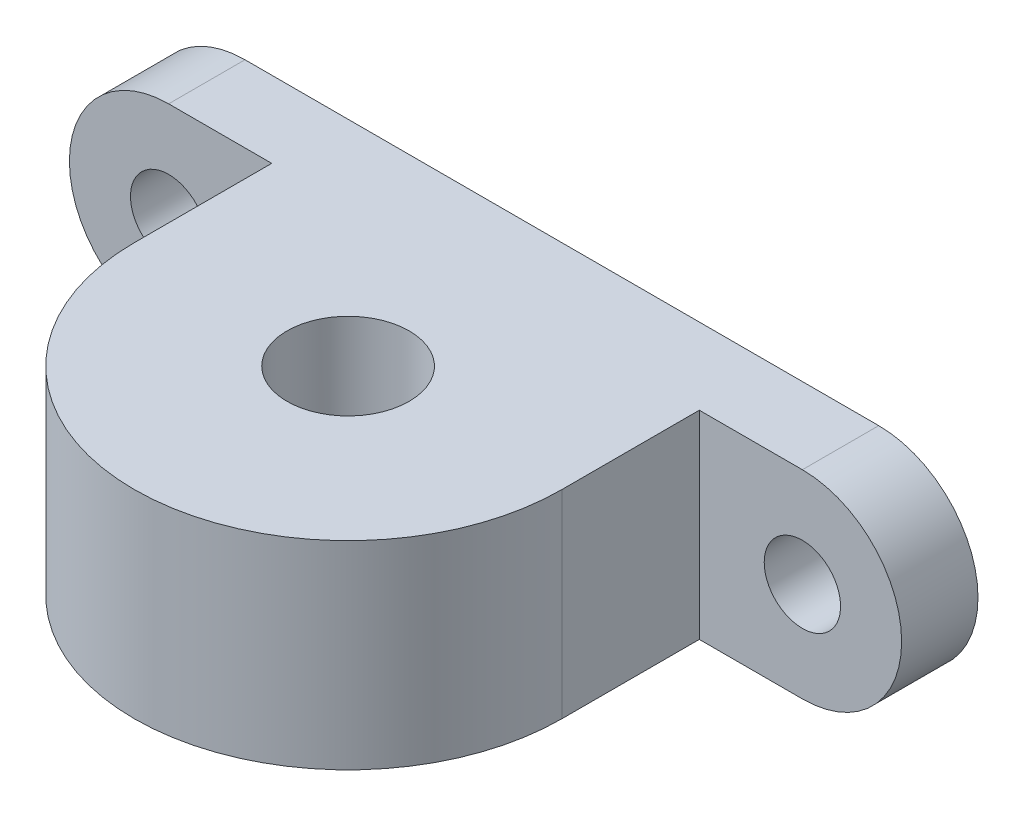
ISO-10303-21;
HEADER;
FILE_DESCRIPTION(('STEP AP214'),'2;1');
FILE_NAME('part.step','',(''),(''),'','','');
FILE_SCHEMA(('AUTOMOTIVE_DESIGN { 1 0 10303 214 1 1 1 1 }'));
ENDSEC;
DATA;
#1=APPLICATION_CONTEXT('core data for automotive mechanical design processes');
#2=APPLICATION_PROTOCOL_DEFINITION('international standard','automotive_design',2000,#1);
#3=PRODUCT_CONTEXT('',#1,'mechanical');
#4=PRODUCT('Part','Part','',(#3));
#5=PRODUCT_RELATED_PRODUCT_CATEGORY('part','',(#4));
#6=PRODUCT_DEFINITION_FORMATION('','',#4);
#7=PRODUCT_DEFINITION_CONTEXT('part definition',#1,'design');
#8=PRODUCT_DEFINITION('design','',#6,#7);
#9=PRODUCT_DEFINITION_SHAPE('','',#8);
#10=(LENGTH_UNIT() NAMED_UNIT(*) SI_UNIT(.MILLI.,.METRE.));
#11=(NAMED_UNIT(*) PLANE_ANGLE_UNIT() SI_UNIT($,.RADIAN.));
#12=(NAMED_UNIT(*) SI_UNIT($,.STERADIAN.) SOLID_ANGLE_UNIT());
#13=UNCERTAINTY_MEASURE_WITH_UNIT(LENGTH_MEASURE(1.E-05),#10,'distance_accuracy_value','');
#14=(GEOMETRIC_REPRESENTATION_CONTEXT(3) GLOBAL_UNCERTAINTY_ASSIGNED_CONTEXT((#13)) GLOBAL_UNIT_ASSIGNED_CONTEXT((#10,
#11,#12)) REPRESENTATION_CONTEXT('',''));
#15=CARTESIAN_POINT('',(0.,0.,0.));
#16=DIRECTION('',(0.,0.,1.));
#17=DIRECTION('',(1.,0.,0.));
#18=AXIS2_PLACEMENT_3D('',#15,#16,#17);
#19=CARTESIAN_POINT('',(-20.75,0.,5.));
#20=DIRECTION('',(0.,0.,1.));
#21=DIRECTION('',(1.,0.,0.));
#22=AXIS2_PLACEMENT_3D('',#19,#20,#21);
#23=PLANE('',#22);
#24=CARTESIAN_POINT('',(20.75,0.,5.));
#25=DIRECTION('',(0.,0.,1.));
#26=DIRECTION('',(-1.,0.,0.));
#27=AXIS2_PLACEMENT_3D('',#24,#25,#26);
#28=CIRCLE('',#27,2.5);
#29=CARTESIAN_POINT('',(18.25,0.,5.));
#30=VERTEX_POINT('',#29);
#31=EDGE_CURVE('E143',#30,#30,#28,.T.);
#32=ORIENTED_EDGE('',*,*,#31,.F.);
#33=EDGE_LOOP('',(#32));
#34=FACE_BOUND('',#33,.T.);
#35=DIRECTION('',(-1.,0.,0.));
#36=VECTOR('',#35,1.);
#37=CARTESIAN_POINT('',(-20.75,6.5,5.));
#38=LINE('',#37,#36);
#39=CARTESIAN_POINT('',(20.75,6.5,5.));
#40=VERTEX_POINT('',#39);
#41=CARTESIAN_POINT('',(14.,6.5,5.));
#42=VERTEX_POINT('',#41);
#43=EDGE_CURVE('E59',#40,#42,#38,.T.);
#44=ORIENTED_EDGE('',*,*,#43,.T.);
#45=DIRECTION('',(0.,-1.,0.));
#46=VECTOR('',#45,1.);
#47=CARTESIAN_POINT('',(14.,42.7353418639869,5.));
#48=LINE('',#47,#46);
#49=CARTESIAN_POINT('',(14.,-6.49999999999999,5.));
#50=VERTEX_POINT('',#49);
#51=EDGE_CURVE('E112',#42,#50,#48,.T.);
#52=ORIENTED_EDGE('',*,*,#51,.T.);
#53=DIRECTION('',(1.,0.,0.));
#54=VECTOR('',#53,1.);
#55=CARTESIAN_POINT('',(-20.75,-6.5,5.));
#56=LINE('',#55,#54);
#57=CARTESIAN_POINT('',(20.75,-6.49999999999999,5.));
#58=VERTEX_POINT('',#57);
#59=EDGE_CURVE('E127',#50,#58,#56,.T.);
#60=ORIENTED_EDGE('',*,*,#59,.T.);
#61=CARTESIAN_POINT('',(20.75,0.,5.));
#62=DIRECTION('',(0.,0.,1.));
#63=DIRECTION('',(-1.,0.,0.));
#64=AXIS2_PLACEMENT_3D('',#61,#62,#63);
#65=CIRCLE('',#64,6.49999999999999);
#66=EDGE_CURVE('E161',#58,#40,#65,.T.);
#67=ORIENTED_EDGE('',*,*,#66,.T.);
#68=EDGE_LOOP('',(#44,#52,#60,#67));
#69=FACE_BOUND('',#68,.T.);
#70=ADVANCED_FACE('F36',(#34,#69),#23,.T.);
#71=DIRECTION('',(0.,-1.,0.));
#72=VECTOR('',#71,1.);
#73=CARTESIAN_POINT('',(-14.,42.7353418639869,5.));
#74=LINE('',#73,#72);
#75=CARTESIAN_POINT('',(-14.,6.5,5.));
#76=VERTEX_POINT('',#75);
#77=CARTESIAN_POINT('',(-14.,-6.5,5.));
#78=VERTEX_POINT('',#77);
#79=EDGE_CURVE('E51',#76,#78,#74,.T.);
#80=ORIENTED_EDGE('',*,*,#79,.F.);
#81=CARTESIAN_POINT('',(-20.75,6.5,5.));
#82=VERTEX_POINT('',#81);
#83=EDGE_CURVE('E163',#76,#82,#38,.T.);
#84=ORIENTED_EDGE('',*,*,#83,.T.);
#85=CARTESIAN_POINT('',(-20.75,0.,5.));
#86=DIRECTION('',(0.,0.,1.));
#87=DIRECTION('',(1.,0.,0.));
#88=AXIS2_PLACEMENT_3D('',#85,#86,#87);
#89=CIRCLE('',#88,6.5);
#90=CARTESIAN_POINT('',(-20.75,-6.5,5.));
#91=VERTEX_POINT('',#90);
#92=EDGE_CURVE('E155',#82,#91,#89,.T.);
#93=ORIENTED_EDGE('',*,*,#92,.T.);
#94=EDGE_CURVE('E159',#91,#78,#56,.T.);
#95=ORIENTED_EDGE('',*,*,#94,.T.);
#96=EDGE_LOOP('',(#80,#84,#93,#95));
#97=FACE_BOUND('',#96,.T.);
#98=CARTESIAN_POINT('',(-20.75,0.,5.));
#99=DIRECTION('',(0.,0.,1.));
#100=DIRECTION('',(1.,0.,0.));
#101=AXIS2_PLACEMENT_3D('',#98,#99,#100);
#102=CIRCLE('',#101,2.5);
#103=CARTESIAN_POINT('',(-18.25,0.,5.));
#104=VERTEX_POINT('',#103);
#105=EDGE_CURVE('E149',#104,#104,#102,.T.);
#106=ORIENTED_EDGE('',*,*,#105,.F.);
#107=EDGE_LOOP('',(#106));
#108=FACE_BOUND('',#107,.T.);
#109=ADVANCED_FACE('F195',(#97,#108),#23,.T.);
#110=CARTESIAN_POINT('',(-20.75,0.,0.));
#111=DIRECTION('',(0.,0.,1.));
#112=DIRECTION('',(1.,0.,0.));
#113=AXIS2_PLACEMENT_3D('',#110,#111,#112);
#114=PLANE('',#113);
#115=CARTESIAN_POINT('',(-20.75,0.,0.));
#116=DIRECTION('',(0.,0.,1.));
#117=DIRECTION('',(1.,0.,0.));
#118=AXIS2_PLACEMENT_3D('',#115,#116,#117);
#119=CIRCLE('',#118,6.5);
#120=CARTESIAN_POINT('',(-20.75,6.5,0.));
#121=VERTEX_POINT('',#120);
#122=CARTESIAN_POINT('',(-20.75,-6.5,0.));
#123=VERTEX_POINT('',#122);
#124=EDGE_CURVE('E152',#121,#123,#119,.T.);
#125=ORIENTED_EDGE('',*,*,#124,.F.);
#126=DIRECTION('',(-1.,0.,0.));
#127=VECTOR('',#126,1.);
#128=CARTESIAN_POINT('',(-20.75,6.5,0.));
#129=LINE('',#128,#127);
#130=CARTESIAN_POINT('',(20.75,6.5,0.));
#131=VERTEX_POINT('',#130);
#132=EDGE_CURVE('E158',#131,#121,#129,.T.);
#133=ORIENTED_EDGE('',*,*,#132,.F.);
#134=CARTESIAN_POINT('',(20.75,0.,0.));
#135=DIRECTION('',(0.,0.,1.));
#136=DIRECTION('',(-1.,0.,0.));
#137=AXIS2_PLACEMENT_3D('',#134,#135,#136);
#138=CIRCLE('',#137,6.49999999999999);
#139=CARTESIAN_POINT('',(20.75,-6.49999999999999,0.));
#140=VERTEX_POINT('',#139);
#141=EDGE_CURVE('E170',#140,#131,#138,.T.);
#142=ORIENTED_EDGE('',*,*,#141,.F.);
#143=DIRECTION('',(1.,0.,0.));
#144=VECTOR('',#143,1.);
#145=CARTESIAN_POINT('',(-20.75,-6.5,0.));
#146=LINE('',#145,#144);
#147=EDGE_CURVE('E168',#123,#140,#146,.T.);
#148=ORIENTED_EDGE('',*,*,#147,.F.);
#149=EDGE_LOOP('',(#125,#133,#142,#148));
#150=FACE_BOUND('',#149,.T.);
#151=CARTESIAN_POINT('',(-20.75,0.,0.));
#152=DIRECTION('',(0.,0.,1.));
#153=DIRECTION('',(1.,0.,0.));
#154=AXIS2_PLACEMENT_3D('',#151,#152,#153);
#155=CIRCLE('',#154,2.5);
#156=CARTESIAN_POINT('',(-18.25,0.,0.));
#157=VERTEX_POINT('',#156);
#158=EDGE_CURVE('E146',#157,#157,#155,.T.);
#159=ORIENTED_EDGE('',*,*,#158,.T.);
#160=EDGE_LOOP('',(#159));
#161=FACE_BOUND('',#160,.T.);
#162=CARTESIAN_POINT('',(20.75,0.,0.));
#163=DIRECTION('',(0.,0.,1.));
#164=DIRECTION('',(-1.,0.,0.));
#165=AXIS2_PLACEMENT_3D('',#162,#163,#164);
#166=CIRCLE('',#165,2.5);
#167=CARTESIAN_POINT('',(18.25,0.,0.));
#168=VERTEX_POINT('',#167);
#169=EDGE_CURVE('E142',#168,#168,#166,.T.);
#170=ORIENTED_EDGE('',*,*,#169,.T.);
#171=EDGE_LOOP('',(#170));
#172=FACE_BOUND('',#171,.T.);
#173=ADVANCED_FACE('F186',(#150,#161,#172),#114,.F.);
#174=CARTESIAN_POINT('',(-20.75,0.,5.));
#175=DIRECTION('',(0.,0.,-1.));
#176=DIRECTION('',(-1.,0.,0.));
#177=AXIS2_PLACEMENT_3D('',#174,#175,#176);
#178=CYLINDRICAL_SURFACE('',#177,6.5);
#179=ORIENTED_EDGE('',*,*,#124,.T.);
#180=DIRECTION('',(0.,0.,-1.));
#181=VECTOR('',#180,1.);
#182=CARTESIAN_POINT('',(-20.75,-6.5,5.));
#183=LINE('',#182,#181);
#184=EDGE_CURVE('E11',#91,#123,#183,.T.);
#185=ORIENTED_EDGE('',*,*,#184,.F.);
#186=ORIENTED_EDGE('',*,*,#92,.F.);
#187=DIRECTION('',(0.,0.,-1.));
#188=VECTOR('',#187,1.);
#189=CARTESIAN_POINT('',(-20.75,6.5,5.));
#190=LINE('',#189,#188);
#191=EDGE_CURVE('E165',#82,#121,#190,.T.);
#192=ORIENTED_EDGE('',*,*,#191,.T.);
#193=EDGE_LOOP('',(#179,#185,#186,#192));
#194=FACE_BOUND('',#193,.T.);
#195=ADVANCED_FACE('F38',(#194),#178,.T.);
#196=CARTESIAN_POINT('',(-20.75,-6.5,5.));
#197=DIRECTION('',(0.,1.,0.));
#198=DIRECTION('',(-1.,0.,0.));
#199=AXIS2_PLACEMENT_3D('',#196,#197,#198);
#200=PLANE('',#199);
#201=ORIENTED_EDGE('',*,*,#147,.T.);
#202=DIRECTION('',(0.,0.,-1.));
#203=VECTOR('',#202,1.);
#204=CARTESIAN_POINT('',(20.75,-6.49999999999999,5.));
#205=LINE('',#204,#203);
#206=EDGE_CURVE('E44',#58,#140,#205,.T.);
#207=ORIENTED_EDGE('',*,*,#206,.F.);
#208=ORIENTED_EDGE('',*,*,#59,.F.);
#209=DIRECTION('',(0.,0.,1.));
#210=VECTOR('',#209,1.);
#211=CARTESIAN_POINT('',(14.,-6.49999999999999,14.));
#212=LINE('',#211,#210);
#213=CARTESIAN_POINT('',(14.,-6.49999999999999,14.));
#214=VERTEX_POINT('',#213);
#215=EDGE_CURVE('E107',#50,#214,#212,.T.);
#216=ORIENTED_EDGE('',*,*,#215,.T.);
#217=CARTESIAN_POINT('',(0.,-6.49999999999999,14.));
#218=DIRECTION('',(0.,-1.,0.));
#219=DIRECTION('',(1.,0.,0.));
#220=AXIS2_PLACEMENT_3D('',#217,#218,#219);
#221=CIRCLE('',#220,14.);
#222=CARTESIAN_POINT('',(-14.,-6.5,14.));
#223=VERTEX_POINT('',#222);
#224=EDGE_CURVE('E115',#214,#223,#221,.T.);
#225=ORIENTED_EDGE('',*,*,#224,.T.);
#226=DIRECTION('',(0.,0.,-1.));
#227=VECTOR('',#226,1.);
#228=CARTESIAN_POINT('',(-14.,-6.5,14.));
#229=LINE('',#228,#227);
#230=EDGE_CURVE('E121',#223,#78,#229,.T.);
#231=ORIENTED_EDGE('',*,*,#230,.T.);
#232=ORIENTED_EDGE('',*,*,#94,.F.);
#233=ORIENTED_EDGE('',*,*,#184,.T.);
#234=EDGE_LOOP('',(#201,#207,#208,#216,#225,#231,#232,#233));
#235=FACE_BOUND('',#234,.T.);
#236=CARTESIAN_POINT('',(0.,-6.49999999999999,14.));
#237=DIRECTION('',(0.,-1.,0.));
#238=DIRECTION('',(1.,0.,0.));
#239=AXIS2_PLACEMENT_3D('',#236,#237,#238);
#240=CIRCLE('',#239,4.);
#241=CARTESIAN_POINT('',(4.,-6.49999999999999,14.));
#242=VERTEX_POINT('',#241);
#243=EDGE_CURVE('E128',#242,#242,#240,.T.);
#244=ORIENTED_EDGE('',*,*,#243,.F.);
#245=EDGE_LOOP('',(#244));
#246=FACE_BOUND('',#245,.T.);
#247=ADVANCED_FACE('F124',(#235,#246),#200,.F.);
#248=CARTESIAN_POINT('',(20.75,0.,5.));
#249=DIRECTION('',(0.,0.,-1.));
#250=DIRECTION('',(-1.,0.,0.));
#251=AXIS2_PLACEMENT_3D('',#248,#249,#250);
#252=CYLINDRICAL_SURFACE('',#251,6.49999999999999);
#253=ORIENTED_EDGE('',*,*,#141,.T.);
#254=DIRECTION('',(0.,0.,-1.));
#255=VECTOR('',#254,1.);
#256=CARTESIAN_POINT('',(20.75,6.5,5.));
#257=LINE('',#256,#255);
#258=EDGE_CURVE('E175',#40,#131,#257,.T.);
#259=ORIENTED_EDGE('',*,*,#258,.F.);
#260=ORIENTED_EDGE('',*,*,#66,.F.);
#261=ORIENTED_EDGE('',*,*,#206,.T.);
#262=EDGE_LOOP('',(#253,#259,#260,#261));
#263=FACE_BOUND('',#262,.T.);
#264=ADVANCED_FACE('F181',(#263),#252,.T.);
#265=CARTESIAN_POINT('',(-20.75,6.5,5.));
#266=DIRECTION('',(0.,-1.,0.));
#267=DIRECTION('',(0.,0.,-1.));
#268=AXIS2_PLACEMENT_3D('',#265,#266,#267);
#269=PLANE('',#268);
#270=ORIENTED_EDGE('',*,*,#132,.T.);
#271=ORIENTED_EDGE('',*,*,#191,.F.);
#272=ORIENTED_EDGE('',*,*,#83,.F.);
#273=DIRECTION('',(0.,0.,1.));
#274=VECTOR('',#273,1.);
#275=CARTESIAN_POINT('',(-14.,6.5,14.));
#276=LINE('',#275,#274);
#277=CARTESIAN_POINT('',(-14.,6.5,14.));
#278=VERTEX_POINT('',#277);
#279=EDGE_CURVE('E198',#76,#278,#276,.T.);
#280=ORIENTED_EDGE('',*,*,#279,.T.);
#281=CARTESIAN_POINT('',(0.,6.5,14.));
#282=DIRECTION('',(0.,-1.,0.));
#283=DIRECTION('',(0.,0.,-1.));
#284=AXIS2_PLACEMENT_3D('',#281,#282,#283);
#285=CIRCLE('',#284,14.);
#286=CARTESIAN_POINT('',(14.,6.5,14.));
#287=VERTEX_POINT('',#286);
#288=EDGE_CURVE('E136',#278,#287,#285,.F.);
#289=ORIENTED_EDGE('',*,*,#288,.T.);
#290=DIRECTION('',(0.,0.,-1.));
#291=VECTOR('',#290,1.);
#292=CARTESIAN_POINT('',(14.,6.5,14.));
#293=LINE('',#292,#291);
#294=EDGE_CURVE('E108',#287,#42,#293,.T.);
#295=ORIENTED_EDGE('',*,*,#294,.T.);
#296=ORIENTED_EDGE('',*,*,#43,.F.);
#297=ORIENTED_EDGE('',*,*,#258,.T.);
#298=EDGE_LOOP('',(#270,#271,#272,#280,#289,#295,#296,#297));
#299=FACE_BOUND('',#298,.T.);
#300=CARTESIAN_POINT('',(0.,6.5,14.));
#301=DIRECTION('',(0.,-1.,0.));
#302=DIRECTION('',(0.,0.,-1.));
#303=AXIS2_PLACEMENT_3D('',#300,#301,#302);
#304=CIRCLE('',#303,4.);
#305=CARTESIAN_POINT('',(0.,6.5,10.));
#306=VERTEX_POINT('',#305);
#307=EDGE_CURVE('E139',#306,#306,#304,.F.);
#308=ORIENTED_EDGE('',*,*,#307,.F.);
#309=EDGE_LOOP('',(#308));
#310=FACE_BOUND('',#309,.T.);
#311=ADVANCED_FACE('F190',(#299,#310),#269,.F.);
#312=CARTESIAN_POINT('',(-20.75,0.,5.));
#313=DIRECTION('',(0.,0.,-1.));
#314=DIRECTION('',(-1.,0.,0.));
#315=AXIS2_PLACEMENT_3D('',#312,#313,#314);
#316=CYLINDRICAL_SURFACE('',#315,2.5);
#317=ORIENTED_EDGE('',*,*,#105,.T.);
#318=EDGE_LOOP('',(#317));
#319=FACE_BOUND('',#318,.T.);
#320=ORIENTED_EDGE('',*,*,#158,.F.);
#321=EDGE_LOOP('',(#320));
#322=FACE_BOUND('',#321,.T.);
#323=ADVANCED_FACE('F212',(#319,#322),#316,.F.);
#324=CARTESIAN_POINT('',(20.75,0.,5.));
#325=DIRECTION('',(0.,0.,-1.));
#326=DIRECTION('',(-1.,0.,0.));
#327=AXIS2_PLACEMENT_3D('',#324,#325,#326);
#328=CYLINDRICAL_SURFACE('',#327,2.5);
#329=ORIENTED_EDGE('',*,*,#31,.T.);
#330=EDGE_LOOP('',(#329));
#331=FACE_BOUND('',#330,.T.);
#332=ORIENTED_EDGE('',*,*,#169,.F.);
#333=EDGE_LOOP('',(#332));
#334=FACE_BOUND('',#333,.T.);
#335=ADVANCED_FACE('F259',(#331,#334),#328,.F.);
#336=CARTESIAN_POINT('',(14.,42.7353418639869,14.));
#337=DIRECTION('',(1.,0.,0.));
#338=DIRECTION('',(0.,1.,0.));
#339=AXIS2_PLACEMENT_3D('',#336,#337,#338);
#340=PLANE('',#339);
#341=ORIENTED_EDGE('',*,*,#294,.F.);
#342=DIRECTION('',(0.,-1.,0.));
#343=VECTOR('',#342,1.);
#344=CARTESIAN_POINT('',(14.,42.7353418639869,14.));
#345=LINE('',#344,#343);
#346=EDGE_CURVE('E102',#287,#214,#345,.T.);
#347=ORIENTED_EDGE('',*,*,#346,.T.);
#348=ORIENTED_EDGE('',*,*,#215,.F.);
#349=ORIENTED_EDGE('',*,*,#51,.F.);
#350=EDGE_LOOP('',(#341,#347,#348,#349));
#351=FACE_BOUND('',#350,.T.);
#352=ADVANCED_FACE('F104',(#351),#340,.T.);
#353=CARTESIAN_POINT('',(0.,42.7353418639869,14.));
#354=DIRECTION('',(0.,-1.,0.));
#355=DIRECTION('',(1.,0.,0.));
#356=AXIS2_PLACEMENT_3D('',#353,#354,#355);
#357=CYLINDRICAL_SURFACE('',#356,14.);
#358=ORIENTED_EDGE('',*,*,#288,.F.);
#359=DIRECTION('',(0.,-1.,0.));
#360=VECTOR('',#359,1.);
#361=CARTESIAN_POINT('',(-14.,42.7353418639869,14.));
#362=LINE('',#361,#360);
#363=EDGE_CURVE('E111',#278,#223,#362,.T.);
#364=ORIENTED_EDGE('',*,*,#363,.T.);
#365=ORIENTED_EDGE('',*,*,#224,.F.);
#366=ORIENTED_EDGE('',*,*,#346,.F.);
#367=EDGE_LOOP('',(#358,#364,#365,#366));
#368=FACE_BOUND('',#367,.T.);
#369=ADVANCED_FACE('F116',(#368),#357,.T.);
#370=CARTESIAN_POINT('',(-14.,42.7353418639869,14.));
#371=DIRECTION('',(-1.,0.,0.));
#372=DIRECTION('',(0.,-1.,0.));
#373=AXIS2_PLACEMENT_3D('',#370,#371,#372);
#374=PLANE('',#373);
#375=ORIENTED_EDGE('',*,*,#279,.F.);
#376=ORIENTED_EDGE('',*,*,#79,.T.);
#377=ORIENTED_EDGE('',*,*,#230,.F.);
#378=ORIENTED_EDGE('',*,*,#363,.F.);
#379=EDGE_LOOP('',(#375,#376,#377,#378));
#380=FACE_BOUND('',#379,.T.);
#381=ADVANCED_FACE('F200',(#380),#374,.T.);
#382=CARTESIAN_POINT('',(0.,42.7353418639869,14.));
#383=DIRECTION('',(0.,-1.,0.));
#384=DIRECTION('',(1.,0.,0.));
#385=AXIS2_PLACEMENT_3D('',#382,#383,#384);
#386=CYLINDRICAL_SURFACE('',#385,4.);
#387=ORIENTED_EDGE('',*,*,#307,.T.);
#388=EDGE_LOOP('',(#387));
#389=FACE_BOUND('',#388,.T.);
#390=ORIENTED_EDGE('',*,*,#243,.T.);
#391=EDGE_LOOP('',(#390));
#392=FACE_BOUND('',#391,.T.);
#393=ADVANCED_FACE('F277',(#389,#392),#386,.F.);
#394=CLOSED_SHELL('',(#70,#109,#173,#195,#247,#264,#311,#323,#335,#352,#369,#381,#393));
#395=MANIFOLD_SOLID_BREP('B2',#394);
#396=ADVANCED_BREP_SHAPE_REPRESENTATION('',(#18,#395),#14);
#397=SHAPE_DEFINITION_REPRESENTATION(#9,#396);
ENDSEC;
END-ISO-10303-21;
